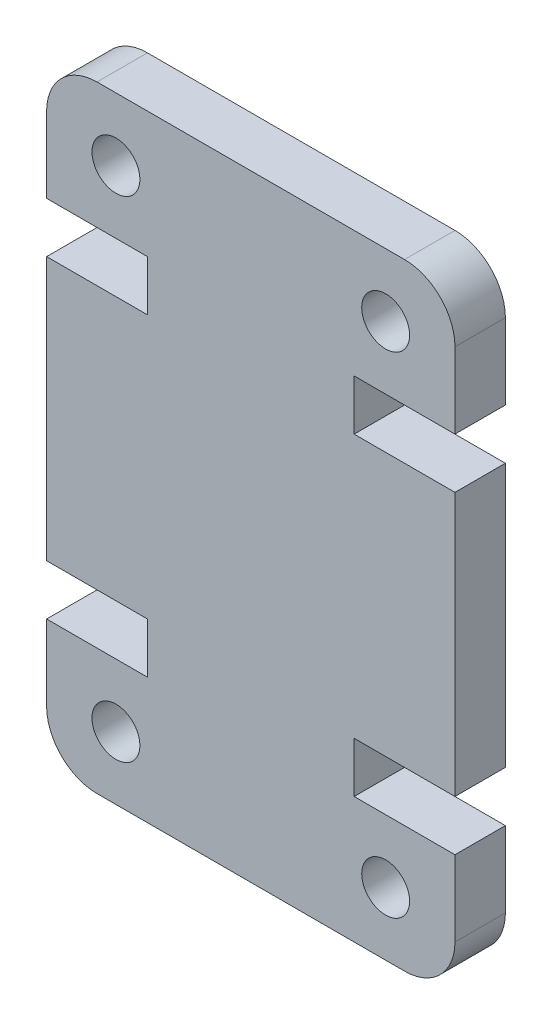
ISO-10303-21;
HEADER;
FILE_DESCRIPTION(('STEP AP214'),'2;1');
FILE_NAME('part.step','',(''),(''),'','','');
FILE_SCHEMA(('AUTOMOTIVE_DESIGN { 1 0 10303 214 1 1 1 1 }'));
ENDSEC;
DATA;
#1=APPLICATION_CONTEXT('core data for automotive mechanical design processes');
#2=APPLICATION_PROTOCOL_DEFINITION('international standard','automotive_design',2000,#1);
#3=PRODUCT_CONTEXT('',#1,'mechanical');
#4=PRODUCT('Part','Part','',(#3));
#5=PRODUCT_RELATED_PRODUCT_CATEGORY('part','',(#4));
#6=PRODUCT_DEFINITION_FORMATION('','',#4);
#7=PRODUCT_DEFINITION_CONTEXT('part definition',#1,'design');
#8=PRODUCT_DEFINITION('design','',#6,#7);
#9=PRODUCT_DEFINITION_SHAPE('','',#8);
#10=(LENGTH_UNIT() NAMED_UNIT(*) SI_UNIT(.MILLI.,.METRE.));
#11=(NAMED_UNIT(*) PLANE_ANGLE_UNIT() SI_UNIT($,.RADIAN.));
#12=(NAMED_UNIT(*) SI_UNIT($,.STERADIAN.) SOLID_ANGLE_UNIT());
#13=UNCERTAINTY_MEASURE_WITH_UNIT(LENGTH_MEASURE(1.E-05),#10,'distance_accuracy_value','');
#14=(GEOMETRIC_REPRESENTATION_CONTEXT(3) GLOBAL_UNCERTAINTY_ASSIGNED_CONTEXT((#13)) GLOBAL_UNIT_ASSIGNED_CONTEXT((#10,
#11,#12)) REPRESENTATION_CONTEXT('',''));
#15=CARTESIAN_POINT('',(0.,0.,0.));
#16=DIRECTION('',(0.,0.,1.));
#17=DIRECTION('',(1.,0.,0.));
#18=AXIS2_PLACEMENT_3D('',#15,#16,#17);
#19=CARTESIAN_POINT('',(14.2,2.,4.));
#20=DIRECTION('',(0.,0.,-1.));
#21=DIRECTION('',(-1.,0.,0.));
#22=AXIS2_PLACEMENT_3D('',#19,#20,#21);
#23=CYLINDRICAL_SURFACE('',#22,2.);
#24=CARTESIAN_POINT('',(14.2,2.,2.));
#25=DIRECTION('',(0.,0.,-1.));
#26=DIRECTION('',(-1.,0.,0.));
#27=AXIS2_PLACEMENT_3D('',#24,#25,#26);
#28=CIRCLE('',#27,2.);
#29=CARTESIAN_POINT('',(16.2,2.00000000000001,2.));
#30=VERTEX_POINT('',#29);
#31=CARTESIAN_POINT('',(14.2,0.,2.));
#32=VERTEX_POINT('',#31);
#33=EDGE_CURVE('E47',#30,#32,#28,.T.);
#34=ORIENTED_EDGE('',*,*,#33,.F.);
#35=DIRECTION('',(0.,0.,-1.));
#36=VECTOR('',#35,1.);
#37=CARTESIAN_POINT('',(16.2,2.,4.));
#38=LINE('',#37,#36);
#39=CARTESIAN_POINT('',(16.2,2.,4.));
#40=VERTEX_POINT('',#39);
#41=EDGE_CURVE('E11',#40,#30,#38,.T.);
#42=ORIENTED_EDGE('',*,*,#41,.F.);
#43=CARTESIAN_POINT('',(14.2,2.,4.));
#44=DIRECTION('',(0.,0.,1.));
#45=DIRECTION('',(-1.,0.,0.));
#46=AXIS2_PLACEMENT_3D('',#43,#44,#45);
#47=CIRCLE('',#46,2.);
#48=CARTESIAN_POINT('',(14.2,0.,4.));
#49=VERTEX_POINT('',#48);
#50=EDGE_CURVE('E352',#49,#40,#47,.T.);
#51=ORIENTED_EDGE('',*,*,#50,.F.);
#52=DIRECTION('',(0.,0.,-1.));
#53=VECTOR('',#52,1.);
#54=CARTESIAN_POINT('',(14.2,0.,4.));
#55=LINE('',#54,#53);
#56=EDGE_CURVE('E213',#49,#32,#55,.T.);
#57=ORIENTED_EDGE('',*,*,#56,.T.);
#58=EDGE_LOOP('',(#34,#42,#51,#57));
#59=FACE_BOUND('',#58,.T.);
#60=ADVANCED_FACE('F32',(#59),#23,.T.);
#61=CARTESIAN_POINT('',(16.2,5.00000000000014,4.));
#62=DIRECTION('',(-1.,0.,0.));
#63=DIRECTION('',(0.,0.,1.));
#64=AXIS2_PLACEMENT_3D('',#61,#62,#63);
#65=PLANE('',#64);
#66=DIRECTION('',(0.,-1.,0.));
#67=VECTOR('',#66,1.);
#68=CARTESIAN_POINT('',(16.2,24.45,2.));
#69=LINE('',#68,#67);
#70=CARTESIAN_POINT('',(16.2,5.00000000000014,2.));
#71=VERTEX_POINT('',#70);
#72=EDGE_CURVE('E289',#71,#30,#69,.T.);
#73=ORIENTED_EDGE('',*,*,#72,.F.);
#74=DIRECTION('',(0.,0.,-1.));
#75=VECTOR('',#74,1.);
#76=CARTESIAN_POINT('',(16.2,5.00000000000014,4.));
#77=LINE('',#76,#75);
#78=CARTESIAN_POINT('',(16.2,5.00000000000014,4.));
#79=VERTEX_POINT('',#78);
#80=EDGE_CURVE('E40',#79,#71,#77,.T.);
#81=ORIENTED_EDGE('',*,*,#80,.F.);
#82=DIRECTION('',(0.,1.,0.));
#83=VECTOR('',#82,1.);
#84=CARTESIAN_POINT('',(16.2,5.00000000000014,4.));
#85=LINE('',#84,#83);
#86=EDGE_CURVE('E288',#40,#79,#85,.T.);
#87=ORIENTED_EDGE('',*,*,#86,.F.);
#88=ORIENTED_EDGE('',*,*,#41,.T.);
#89=EDGE_LOOP('',(#73,#81,#87,#88));
#90=FACE_BOUND('',#89,.T.);
#91=ADVANCED_FACE('F287',(#90),#65,.F.);
#92=CARTESIAN_POINT('',(12.2,5.00000000000014,4.));
#93=DIRECTION('',(0.,-1.,0.));
#94=DIRECTION('',(0.,0.,-1.));
#95=AXIS2_PLACEMENT_3D('',#92,#93,#94);
#96=PLANE('',#95);
#97=DIRECTION('',(1.,0.,0.));
#98=VECTOR('',#97,1.);
#99=CARTESIAN_POINT('',(12.2,5.00000000000014,2.));
#100=LINE('',#99,#98);
#101=CARTESIAN_POINT('',(12.2,5.00000000000014,2.));
#102=VERTEX_POINT('',#101);
#103=EDGE_CURVE('E283',#102,#71,#100,.T.);
#104=ORIENTED_EDGE('',*,*,#103,.F.);
#105=DIRECTION('',(0.,0.,-1.));
#106=VECTOR('',#105,1.);
#107=CARTESIAN_POINT('',(12.2,5.00000000000014,4.));
#108=LINE('',#107,#106);
#109=CARTESIAN_POINT('',(12.2,5.00000000000014,4.));
#110=VERTEX_POINT('',#109);
#111=EDGE_CURVE('E273',#110,#102,#108,.T.);
#112=ORIENTED_EDGE('',*,*,#111,.F.);
#113=DIRECTION('',(-1.,0.,0.));
#114=VECTOR('',#113,1.);
#115=CARTESIAN_POINT('',(12.2,5.00000000000014,4.));
#116=LINE('',#115,#114);
#117=EDGE_CURVE('E284',#79,#110,#116,.T.);
#118=ORIENTED_EDGE('',*,*,#117,.F.);
#119=ORIENTED_EDGE('',*,*,#80,.T.);
#120=EDGE_LOOP('',(#104,#112,#118,#119));
#121=FACE_BOUND('',#120,.T.);
#122=ADVANCED_FACE('F281',(#121),#96,.F.);
#123=CARTESIAN_POINT('',(12.2,7.00000000000014,4.));
#124=DIRECTION('',(-1.,0.,0.));
#125=DIRECTION('',(0.,0.,1.));
#126=AXIS2_PLACEMENT_3D('',#123,#124,#125);
#127=PLANE('',#126);
#128=DIRECTION('',(0.,-1.,0.));
#129=VECTOR('',#128,1.);
#130=CARTESIAN_POINT('',(12.2,7.00000000000014,2.));
#131=LINE('',#130,#129);
#132=CARTESIAN_POINT('',(12.2,7.00000000000014,2.));
#133=VERTEX_POINT('',#132);
#134=EDGE_CURVE('E336',#133,#102,#131,.T.);
#135=ORIENTED_EDGE('',*,*,#134,.F.);
#136=DIRECTION('',(0.,0.,-1.));
#137=VECTOR('',#136,1.);
#138=CARTESIAN_POINT('',(12.2,7.00000000000014,4.));
#139=LINE('',#138,#137);
#140=CARTESIAN_POINT('',(12.2,7.00000000000014,4.));
#141=VERTEX_POINT('',#140);
#142=EDGE_CURVE('E270',#141,#133,#139,.T.);
#143=ORIENTED_EDGE('',*,*,#142,.F.);
#144=DIRECTION('',(0.,1.,0.));
#145=VECTOR('',#144,1.);
#146=CARTESIAN_POINT('',(12.2,7.00000000000014,4.));
#147=LINE('',#146,#145);
#148=EDGE_CURVE('E356',#110,#141,#147,.T.);
#149=ORIENTED_EDGE('',*,*,#148,.F.);
#150=ORIENTED_EDGE('',*,*,#111,.T.);
#151=EDGE_LOOP('',(#135,#143,#149,#150));
#152=FACE_BOUND('',#151,.T.);
#153=ADVANCED_FACE('F459',(#152),#127,.F.);
#154=CARTESIAN_POINT('',(16.2,7.00000000000014,4.));
#155=DIRECTION('',(0.,1.,0.));
#156=DIRECTION('',(-1.,0.,0.));
#157=AXIS2_PLACEMENT_3D('',#154,#155,#156);
#158=PLANE('',#157);
#159=DIRECTION('',(-1.,0.,0.));
#160=VECTOR('',#159,1.);
#161=CARTESIAN_POINT('',(16.2,7.00000000000014,2.));
#162=LINE('',#161,#160);
#163=CARTESIAN_POINT('',(16.2,7.00000000000014,2.));
#164=VERTEX_POINT('',#163);
#165=EDGE_CURVE('E334',#164,#133,#162,.T.);
#166=ORIENTED_EDGE('',*,*,#165,.F.);
#167=DIRECTION('',(0.,0.,-1.));
#168=VECTOR('',#167,1.);
#169=CARTESIAN_POINT('',(16.2,7.00000000000014,4.));
#170=LINE('',#169,#168);
#171=CARTESIAN_POINT('',(16.2,7.00000000000014,4.));
#172=VERTEX_POINT('',#171);
#173=EDGE_CURVE('E267',#172,#164,#170,.T.);
#174=ORIENTED_EDGE('',*,*,#173,.F.);
#175=DIRECTION('',(1.,0.,0.));
#176=VECTOR('',#175,1.);
#177=CARTESIAN_POINT('',(16.2,7.00000000000014,4.));
#178=LINE('',#177,#176);
#179=EDGE_CURVE('E358',#141,#172,#178,.T.);
#180=ORIENTED_EDGE('',*,*,#179,.F.);
#181=ORIENTED_EDGE('',*,*,#142,.T.);
#182=EDGE_LOOP('',(#166,#174,#180,#181));
#183=FACE_BOUND('',#182,.T.);
#184=ADVANCED_FACE('F455',(#183),#158,.F.);
#185=CARTESIAN_POINT('',(16.2,17.4499999999999,4.));
#186=DIRECTION('',(-1.,0.,0.));
#187=DIRECTION('',(0.,0.,1.));
#188=AXIS2_PLACEMENT_3D('',#185,#186,#187);
#189=PLANE('',#188);
#190=CARTESIAN_POINT('',(16.2,17.4499999999999,2.));
#191=VERTEX_POINT('',#190);
#192=EDGE_CURVE('E291',#191,#164,#69,.T.);
#193=ORIENTED_EDGE('',*,*,#192,.F.);
#194=DIRECTION('',(0.,0.,-1.));
#195=VECTOR('',#194,1.);
#196=CARTESIAN_POINT('',(16.2,17.4499999999999,4.));
#197=LINE('',#196,#195);
#198=CARTESIAN_POINT('',(16.2,17.4499999999999,4.));
#199=VERTEX_POINT('',#198);
#200=EDGE_CURVE('E264',#199,#191,#197,.T.);
#201=ORIENTED_EDGE('',*,*,#200,.F.);
#202=DIRECTION('',(0.,1.,0.));
#203=VECTOR('',#202,1.);
#204=CARTESIAN_POINT('',(16.2,17.4499999999999,4.));
#205=LINE('',#204,#203);
#206=EDGE_CURVE('E360',#172,#199,#205,.T.);
#207=ORIENTED_EDGE('',*,*,#206,.F.);
#208=ORIENTED_EDGE('',*,*,#173,.T.);
#209=EDGE_LOOP('',(#193,#201,#207,#208));
#210=FACE_BOUND('',#209,.T.);
#211=ADVANCED_FACE('F450',(#210),#189,.F.);
#212=CARTESIAN_POINT('',(16.2,17.4499999999999,4.));
#213=DIRECTION('',(0.,-1.,0.));
#214=DIRECTION('',(1.,0.,0.));
#215=AXIS2_PLACEMENT_3D('',#212,#213,#214);
#216=PLANE('',#215);
#217=DIRECTION('',(1.,0.,0.));
#218=VECTOR('',#217,1.);
#219=CARTESIAN_POINT('',(16.2,17.4499999999999,2.));
#220=LINE('',#219,#218);
#221=CARTESIAN_POINT('',(12.2,17.4499999999999,2.));
#222=VERTEX_POINT('',#221);
#223=EDGE_CURVE('E332',#222,#191,#220,.T.);
#224=ORIENTED_EDGE('',*,*,#223,.F.);
#225=DIRECTION('',(0.,0.,-1.));
#226=VECTOR('',#225,1.);
#227=CARTESIAN_POINT('',(12.2,17.4499999999999,4.));
#228=LINE('',#227,#226);
#229=CARTESIAN_POINT('',(12.2,17.4499999999999,4.));
#230=VERTEX_POINT('',#229);
#231=EDGE_CURVE('E261',#230,#222,#228,.T.);
#232=ORIENTED_EDGE('',*,*,#231,.F.);
#233=DIRECTION('',(-1.,0.,0.));
#234=VECTOR('',#233,1.);
#235=CARTESIAN_POINT('',(16.2,17.4499999999999,4.));
#236=LINE('',#235,#234);
#237=EDGE_CURVE('E362',#199,#230,#236,.T.);
#238=ORIENTED_EDGE('',*,*,#237,.F.);
#239=ORIENTED_EDGE('',*,*,#200,.T.);
#240=EDGE_LOOP('',(#224,#232,#238,#239));
#241=FACE_BOUND('',#240,.T.);
#242=ADVANCED_FACE('F445',(#241),#216,.F.);
#243=CARTESIAN_POINT('',(12.2,17.4499999999999,4.));
#244=DIRECTION('',(-1.,0.,0.));
#245=DIRECTION('',(0.,0.,1.));
#246=AXIS2_PLACEMENT_3D('',#243,#244,#245);
#247=PLANE('',#246);
#248=DIRECTION('',(0.,-1.,0.));
#249=VECTOR('',#248,1.);
#250=CARTESIAN_POINT('',(12.2,17.4499999999999,2.));
#251=LINE('',#250,#249);
#252=CARTESIAN_POINT('',(12.2,19.4499999999999,2.));
#253=VERTEX_POINT('',#252);
#254=EDGE_CURVE('E330',#253,#222,#251,.T.);
#255=ORIENTED_EDGE('',*,*,#254,.F.);
#256=DIRECTION('',(0.,0.,-1.));
#257=VECTOR('',#256,1.);
#258=CARTESIAN_POINT('',(12.2,19.4499999999999,4.));
#259=LINE('',#258,#257);
#260=CARTESIAN_POINT('',(12.2,19.4499999999999,4.));
#261=VERTEX_POINT('',#260);
#262=EDGE_CURVE('E258',#261,#253,#259,.T.);
#263=ORIENTED_EDGE('',*,*,#262,.F.);
#264=DIRECTION('',(0.,1.,0.));
#265=VECTOR('',#264,1.);
#266=CARTESIAN_POINT('',(12.2,17.4499999999999,4.));
#267=LINE('',#266,#265);
#268=EDGE_CURVE('E364',#230,#261,#267,.T.);
#269=ORIENTED_EDGE('',*,*,#268,.F.);
#270=ORIENTED_EDGE('',*,*,#231,.T.);
#271=EDGE_LOOP('',(#255,#263,#269,#270));
#272=FACE_BOUND('',#271,.T.);
#273=ADVANCED_FACE('F440',(#272),#247,.F.);
#274=CARTESIAN_POINT('',(12.2,19.4499999999999,4.));
#275=DIRECTION('',(0.,1.,0.));
#276=DIRECTION('',(0.,0.,1.));
#277=AXIS2_PLACEMENT_3D('',#274,#275,#276);
#278=PLANE('',#277);
#279=DIRECTION('',(-1.,0.,0.));
#280=VECTOR('',#279,1.);
#281=CARTESIAN_POINT('',(12.2,19.4499999999999,2.));
#282=LINE('',#281,#280);
#283=CARTESIAN_POINT('',(16.2,19.4499999999999,2.));
#284=VERTEX_POINT('',#283);
#285=EDGE_CURVE('E328',#284,#253,#282,.T.);
#286=ORIENTED_EDGE('',*,*,#285,.F.);
#287=DIRECTION('',(0.,0.,-1.));
#288=VECTOR('',#287,1.);
#289=CARTESIAN_POINT('',(16.2,19.4499999999999,4.));
#290=LINE('',#289,#288);
#291=CARTESIAN_POINT('',(16.2,19.4499999999999,4.));
#292=VERTEX_POINT('',#291);
#293=EDGE_CURVE('E255',#292,#284,#290,.T.);
#294=ORIENTED_EDGE('',*,*,#293,.F.);
#295=DIRECTION('',(1.,0.,0.));
#296=VECTOR('',#295,1.);
#297=CARTESIAN_POINT('',(12.2,19.4499999999999,4.));
#298=LINE('',#297,#296);
#299=EDGE_CURVE('E366',#261,#292,#298,.T.);
#300=ORIENTED_EDGE('',*,*,#299,.F.);
#301=ORIENTED_EDGE('',*,*,#262,.T.);
#302=EDGE_LOOP('',(#286,#294,#300,#301));
#303=FACE_BOUND('',#302,.T.);
#304=ADVANCED_FACE('F435',(#303),#278,.F.);
#305=CARTESIAN_POINT('',(16.2,19.4499999999999,4.));
#306=DIRECTION('',(-1.,0.,0.));
#307=DIRECTION('',(0.,0.,1.));
#308=AXIS2_PLACEMENT_3D('',#305,#306,#307);
#309=PLANE('',#308);
#310=CARTESIAN_POINT('',(16.2,22.45,2.));
#311=VERTEX_POINT('',#310);
#312=EDGE_CURVE('E294',#311,#284,#69,.T.);
#313=ORIENTED_EDGE('',*,*,#312,.F.);
#314=DIRECTION('',(0.,0.,-1.));
#315=VECTOR('',#314,1.);
#316=CARTESIAN_POINT('',(16.2,22.45,4.));
#317=LINE('',#316,#315);
#318=CARTESIAN_POINT('',(16.2,22.45,4.));
#319=VERTEX_POINT('',#318);
#320=EDGE_CURVE('E252',#319,#311,#317,.T.);
#321=ORIENTED_EDGE('',*,*,#320,.F.);
#322=DIRECTION('',(0.,1.,0.));
#323=VECTOR('',#322,1.);
#324=CARTESIAN_POINT('',(16.2,19.4499999999999,4.));
#325=LINE('',#324,#323);
#326=EDGE_CURVE('E368',#292,#319,#325,.T.);
#327=ORIENTED_EDGE('',*,*,#326,.F.);
#328=ORIENTED_EDGE('',*,*,#293,.T.);
#329=EDGE_LOOP('',(#313,#321,#327,#328));
#330=FACE_BOUND('',#329,.T.);
#331=ADVANCED_FACE('F431',(#330),#309,.F.);
#332=CARTESIAN_POINT('',(14.2,22.45,4.));
#333=DIRECTION('',(0.,0.,-1.));
#334=DIRECTION('',(-1.,0.,0.));
#335=AXIS2_PLACEMENT_3D('',#332,#333,#334);
#336=CYLINDRICAL_SURFACE('',#335,2.);
#337=CARTESIAN_POINT('',(14.2,22.45,2.));
#338=DIRECTION('',(0.,0.,-1.));
#339=DIRECTION('',(-1.,0.,0.));
#340=AXIS2_PLACEMENT_3D('',#337,#338,#339);
#341=CIRCLE('',#340,2.);
#342=CARTESIAN_POINT('',(14.2,24.45,2.));
#343=VERTEX_POINT('',#342);
#344=EDGE_CURVE('E326',#343,#311,#341,.T.);
#345=ORIENTED_EDGE('',*,*,#344,.F.);
#346=DIRECTION('',(0.,0.,-1.));
#347=VECTOR('',#346,1.);
#348=CARTESIAN_POINT('',(14.2,24.45,4.));
#349=LINE('',#348,#347);
#350=CARTESIAN_POINT('',(14.2,24.45,4.));
#351=VERTEX_POINT('',#350);
#352=EDGE_CURVE('E249',#351,#343,#349,.T.);
#353=ORIENTED_EDGE('',*,*,#352,.F.);
#354=CARTESIAN_POINT('',(14.2,22.45,4.));
#355=DIRECTION('',(0.,0.,1.));
#356=DIRECTION('',(1.,0.,0.));
#357=AXIS2_PLACEMENT_3D('',#354,#355,#356);
#358=CIRCLE('',#357,2.);
#359=EDGE_CURVE('E370',#319,#351,#358,.T.);
#360=ORIENTED_EDGE('',*,*,#359,.F.);
#361=ORIENTED_EDGE('',*,*,#320,.T.);
#362=EDGE_LOOP('',(#345,#353,#360,#361));
#363=FACE_BOUND('',#362,.T.);
#364=ADVANCED_FACE('F427',(#363),#336,.T.);
#365=CARTESIAN_POINT('',(1.99999999999999,24.45,4.));
#366=DIRECTION('',(0.,-1.,0.));
#367=DIRECTION('',(0.,0.,-1.));
#368=AXIS2_PLACEMENT_3D('',#365,#366,#367);
#369=PLANE('',#368);
#370=DIRECTION('',(1.,0.,0.));
#371=VECTOR('',#370,1.);
#372=CARTESIAN_POINT('',(0.,24.45,2.));
#373=LINE('',#372,#371);
#374=CARTESIAN_POINT('',(2.,24.45,2.));
#375=VERTEX_POINT('',#374);
#376=EDGE_CURVE('E292',#375,#343,#373,.T.);
#377=ORIENTED_EDGE('',*,*,#376,.F.);
#378=DIRECTION('',(0.,0.,-1.));
#379=VECTOR('',#378,1.);
#380=CARTESIAN_POINT('',(1.99999999999999,24.45,4.));
#381=LINE('',#380,#379);
#382=CARTESIAN_POINT('',(1.99999999999999,24.45,4.));
#383=VERTEX_POINT('',#382);
#384=EDGE_CURVE('E246',#383,#375,#381,.T.);
#385=ORIENTED_EDGE('',*,*,#384,.F.);
#386=DIRECTION('',(-1.,0.,0.));
#387=VECTOR('',#386,1.);
#388=CARTESIAN_POINT('',(1.99999999999999,24.45,4.));
#389=LINE('',#388,#387);
#390=EDGE_CURVE('E372',#351,#383,#389,.T.);
#391=ORIENTED_EDGE('',*,*,#390,.F.);
#392=ORIENTED_EDGE('',*,*,#352,.T.);
#393=EDGE_LOOP('',(#377,#385,#391,#392));
#394=FACE_BOUND('',#393,.T.);
#395=ADVANCED_FACE('F424',(#394),#369,.F.);
#396=CARTESIAN_POINT('',(2.,22.45,4.));
#397=DIRECTION('',(0.,0.,-1.));
#398=DIRECTION('',(-1.,0.,0.));
#399=AXIS2_PLACEMENT_3D('',#396,#397,#398);
#400=CYLINDRICAL_SURFACE('',#399,2.);
#401=CARTESIAN_POINT('',(2.,22.45,2.));
#402=DIRECTION('',(0.,0.,-1.));
#403=DIRECTION('',(-1.,0.,0.));
#404=AXIS2_PLACEMENT_3D('',#401,#402,#403);
#405=CIRCLE('',#404,2.);
#406=CARTESIAN_POINT('',(0.,22.45,2.));
#407=VERTEX_POINT('',#406);
#408=EDGE_CURVE('E324',#407,#375,#405,.T.);
#409=ORIENTED_EDGE('',*,*,#408,.F.);
#410=DIRECTION('',(0.,0.,-1.));
#411=VECTOR('',#410,1.);
#412=CARTESIAN_POINT('',(0.,22.45,4.));
#413=LINE('',#412,#411);
#414=CARTESIAN_POINT('',(0.,22.45,4.));
#415=VERTEX_POINT('',#414);
#416=EDGE_CURVE('E243',#415,#407,#413,.T.);
#417=ORIENTED_EDGE('',*,*,#416,.F.);
#418=CARTESIAN_POINT('',(2.,22.45,4.));
#419=DIRECTION('',(0.,0.,1.));
#420=DIRECTION('',(-1.,0.,0.));
#421=AXIS2_PLACEMENT_3D('',#418,#419,#420);
#422=CIRCLE('',#421,2.);
#423=EDGE_CURVE('E374',#383,#415,#422,.T.);
#424=ORIENTED_EDGE('',*,*,#423,.F.);
#425=ORIENTED_EDGE('',*,*,#384,.T.);
#426=EDGE_LOOP('',(#409,#417,#424,#425));
#427=FACE_BOUND('',#426,.T.);
#428=ADVANCED_FACE('F413',(#427),#400,.T.);
#429=CARTESIAN_POINT('',(0.,19.4499999999999,4.));
#430=DIRECTION('',(1.,0.,0.));
#431=DIRECTION('',(0.,1.,0.));
#432=AXIS2_PLACEMENT_3D('',#429,#430,#431);
#433=PLANE('',#432);
#434=DIRECTION('',(0.,1.,0.));
#435=VECTOR('',#434,1.);
#436=CARTESIAN_POINT('',(0.,0.,2.));
#437=LINE('',#436,#435);
#438=CARTESIAN_POINT('',(0.,19.4499999999999,2.));
#439=VERTEX_POINT('',#438);
#440=EDGE_CURVE('E199',#439,#407,#437,.T.);
#441=ORIENTED_EDGE('',*,*,#440,.F.);
#442=DIRECTION('',(0.,0.,-1.));
#443=VECTOR('',#442,1.);
#444=CARTESIAN_POINT('',(0.,19.4499999999999,4.));
#445=LINE('',#444,#443);
#446=CARTESIAN_POINT('',(0.,19.4499999999999,4.));
#447=VERTEX_POINT('',#446);
#448=EDGE_CURVE('E240',#447,#439,#445,.T.);
#449=ORIENTED_EDGE('',*,*,#448,.F.);
#450=DIRECTION('',(0.,-1.,0.));
#451=VECTOR('',#450,1.);
#452=CARTESIAN_POINT('',(0.,19.4499999999999,4.));
#453=LINE('',#452,#451);
#454=EDGE_CURVE('E376',#415,#447,#453,.T.);
#455=ORIENTED_EDGE('',*,*,#454,.F.);
#456=ORIENTED_EDGE('',*,*,#416,.T.);
#457=EDGE_LOOP('',(#441,#449,#455,#456));
#458=FACE_BOUND('',#457,.T.);
#459=ADVANCED_FACE('F417',(#458),#433,.F.);
#460=CARTESIAN_POINT('',(3.99999999999999,19.4499999999999,4.));
#461=DIRECTION('',(0.,1.,0.));
#462=DIRECTION('',(-1.,0.,0.));
#463=AXIS2_PLACEMENT_3D('',#460,#461,#462);
#464=PLANE('',#463);
#465=DIRECTION('',(-1.,0.,0.));
#466=VECTOR('',#465,1.);
#467=CARTESIAN_POINT('',(3.99999999999999,19.4499999999999,2.));
#468=LINE('',#467,#466);
#469=CARTESIAN_POINT('',(3.99999999999999,19.4499999999999,2.));
#470=VERTEX_POINT('',#469);
#471=EDGE_CURVE('E322',#470,#439,#468,.T.);
#472=ORIENTED_EDGE('',*,*,#471,.F.);
#473=DIRECTION('',(0.,0.,-1.));
#474=VECTOR('',#473,1.);
#475=CARTESIAN_POINT('',(3.99999999999999,19.4499999999999,4.));
#476=LINE('',#475,#474);
#477=CARTESIAN_POINT('',(3.99999999999999,19.4499999999999,4.));
#478=VERTEX_POINT('',#477);
#479=EDGE_CURVE('E237',#478,#470,#476,.T.);
#480=ORIENTED_EDGE('',*,*,#479,.F.);
#481=DIRECTION('',(1.,0.,0.));
#482=VECTOR('',#481,1.);
#483=CARTESIAN_POINT('',(3.99999999999999,19.4499999999999,4.));
#484=LINE('',#483,#482);
#485=EDGE_CURVE('E378',#447,#478,#484,.T.);
#486=ORIENTED_EDGE('',*,*,#485,.F.);
#487=ORIENTED_EDGE('',*,*,#448,.T.);
#488=EDGE_LOOP('',(#472,#480,#486,#487));
#489=FACE_BOUND('',#488,.T.);
#490=ADVANCED_FACE('F494',(#489),#464,.F.);
#491=CARTESIAN_POINT('',(3.99999999999999,17.4499999999999,4.));
#492=DIRECTION('',(1.,0.,0.));
#493=DIRECTION('',(0.,0.,-1.));
#494=AXIS2_PLACEMENT_3D('',#491,#492,#493);
#495=PLANE('',#494);
#496=DIRECTION('',(0.,1.,0.));
#497=VECTOR('',#496,1.);
#498=CARTESIAN_POINT('',(3.99999999999999,17.4499999999999,2.));
#499=LINE('',#498,#497);
#500=CARTESIAN_POINT('',(3.99999999999999,17.4499999999999,2.));
#501=VERTEX_POINT('',#500);
#502=EDGE_CURVE('E320',#501,#470,#499,.T.);
#503=ORIENTED_EDGE('',*,*,#502,.F.);
#504=DIRECTION('',(0.,0.,-1.));
#505=VECTOR('',#504,1.);
#506=CARTESIAN_POINT('',(3.99999999999999,17.4499999999999,4.));
#507=LINE('',#506,#505);
#508=CARTESIAN_POINT('',(3.99999999999999,17.4499999999999,4.));
#509=VERTEX_POINT('',#508);
#510=EDGE_CURVE('E234',#509,#501,#507,.T.);
#511=ORIENTED_EDGE('',*,*,#510,.F.);
#512=DIRECTION('',(0.,-1.,0.));
#513=VECTOR('',#512,1.);
#514=CARTESIAN_POINT('',(3.99999999999999,17.4499999999999,4.));
#515=LINE('',#514,#513);
#516=EDGE_CURVE('E380',#478,#509,#515,.T.);
#517=ORIENTED_EDGE('',*,*,#516,.F.);
#518=ORIENTED_EDGE('',*,*,#479,.T.);
#519=EDGE_LOOP('',(#503,#511,#517,#518));
#520=FACE_BOUND('',#519,.T.);
#521=ADVANCED_FACE('F497',(#520),#495,.F.);
#522=CARTESIAN_POINT('',(0.,17.4499999999999,4.));
#523=DIRECTION('',(0.,-1.,0.));
#524=DIRECTION('',(1.,0.,0.));
#525=AXIS2_PLACEMENT_3D('',#522,#523,#524);
#526=PLANE('',#525);
#527=DIRECTION('',(1.,0.,0.));
#528=VECTOR('',#527,1.);
#529=CARTESIAN_POINT('',(0.,17.4499999999999,2.));
#530=LINE('',#529,#528);
#531=CARTESIAN_POINT('',(0.,17.4499999999999,2.));
#532=VERTEX_POINT('',#531);
#533=EDGE_CURVE('E318',#532,#501,#530,.T.);
#534=ORIENTED_EDGE('',*,*,#533,.F.);
#535=DIRECTION('',(0.,0.,-1.));
#536=VECTOR('',#535,1.);
#537=CARTESIAN_POINT('',(0.,17.4499999999999,4.));
#538=LINE('',#537,#536);
#539=CARTESIAN_POINT('',(0.,17.4499999999999,4.));
#540=VERTEX_POINT('',#539);
#541=EDGE_CURVE('E231',#540,#532,#538,.T.);
#542=ORIENTED_EDGE('',*,*,#541,.F.);
#543=DIRECTION('',(-1.,0.,0.));
#544=VECTOR('',#543,1.);
#545=CARTESIAN_POINT('',(0.,17.4499999999999,4.));
#546=LINE('',#545,#544);
#547=EDGE_CURVE('E382',#509,#540,#546,.T.);
#548=ORIENTED_EDGE('',*,*,#547,.F.);
#549=ORIENTED_EDGE('',*,*,#510,.T.);
#550=EDGE_LOOP('',(#534,#542,#548,#549));
#551=FACE_BOUND('',#550,.T.);
#552=ADVANCED_FACE('F501',(#551),#526,.F.);
#553=CARTESIAN_POINT('',(0.,17.4499999999999,4.));
#554=DIRECTION('',(1.,0.,0.));
#555=DIRECTION('',(0.,0.,-1.));
#556=AXIS2_PLACEMENT_3D('',#553,#554,#555);
#557=PLANE('',#556);
#558=CARTESIAN_POINT('',(0.,7.00000000000013,2.));
#559=VERTEX_POINT('',#558);
#560=EDGE_CURVE('E403',#559,#532,#437,.T.);
#561=ORIENTED_EDGE('',*,*,#560,.F.);
#562=DIRECTION('',(0.,0.,-1.));
#563=VECTOR('',#562,1.);
#564=CARTESIAN_POINT('',(0.,7.00000000000012,4.));
#565=LINE('',#564,#563);
#566=CARTESIAN_POINT('',(0.,7.00000000000012,4.));
#567=VERTEX_POINT('',#566);
#568=EDGE_CURVE('E228',#567,#559,#565,.T.);
#569=ORIENTED_EDGE('',*,*,#568,.F.);
#570=DIRECTION('',(0.,-1.,0.));
#571=VECTOR('',#570,1.);
#572=CARTESIAN_POINT('',(0.,17.4499999999999,4.));
#573=LINE('',#572,#571);
#574=EDGE_CURVE('E384',#540,#567,#573,.T.);
#575=ORIENTED_EDGE('',*,*,#574,.F.);
#576=ORIENTED_EDGE('',*,*,#541,.T.);
#577=EDGE_LOOP('',(#561,#569,#575,#576));
#578=FACE_BOUND('',#577,.T.);
#579=ADVANCED_FACE('F505',(#578),#557,.F.);
#580=CARTESIAN_POINT('',(0.,7.00000000000012,4.));
#581=DIRECTION('',(0.,1.,0.));
#582=DIRECTION('',(-1.,0.,0.));
#583=AXIS2_PLACEMENT_3D('',#580,#581,#582);
#584=PLANE('',#583);
#585=DIRECTION('',(-1.,0.,0.));
#586=VECTOR('',#585,1.);
#587=CARTESIAN_POINT('',(0.,7.00000000000012,2.));
#588=LINE('',#587,#586);
#589=CARTESIAN_POINT('',(4.,7.00000000000014,2.));
#590=VERTEX_POINT('',#589);
#591=EDGE_CURVE('E316',#590,#559,#588,.T.);
#592=ORIENTED_EDGE('',*,*,#591,.F.);
#593=DIRECTION('',(0.,0.,-1.));
#594=VECTOR('',#593,1.);
#595=CARTESIAN_POINT('',(4.,7.00000000000014,4.));
#596=LINE('',#595,#594);
#597=CARTESIAN_POINT('',(4.,7.00000000000014,4.));
#598=VERTEX_POINT('',#597);
#599=EDGE_CURVE('E225',#598,#590,#596,.T.);
#600=ORIENTED_EDGE('',*,*,#599,.F.);
#601=DIRECTION('',(1.,0.,0.));
#602=VECTOR('',#601,1.);
#603=CARTESIAN_POINT('',(0.,7.00000000000012,4.));
#604=LINE('',#603,#602);
#605=EDGE_CURVE('E386',#567,#598,#604,.T.);
#606=ORIENTED_EDGE('',*,*,#605,.F.);
#607=ORIENTED_EDGE('',*,*,#568,.T.);
#608=EDGE_LOOP('',(#592,#600,#606,#607));
#609=FACE_BOUND('',#608,.T.);
#610=ADVANCED_FACE('F509',(#609),#584,.F.);
#611=CARTESIAN_POINT('',(4.,7.00000000000014,4.));
#612=DIRECTION('',(1.,0.,0.));
#613=DIRECTION('',(0.,0.,-1.));
#614=AXIS2_PLACEMENT_3D('',#611,#612,#613);
#615=PLANE('',#614);
#616=DIRECTION('',(0.,1.,0.));
#617=VECTOR('',#616,1.);
#618=CARTESIAN_POINT('',(4.,7.00000000000014,2.));
#619=LINE('',#618,#617);
#620=CARTESIAN_POINT('',(4.,5.00000000000014,2.));
#621=VERTEX_POINT('',#620);
#622=EDGE_CURVE('E314',#621,#590,#619,.T.);
#623=ORIENTED_EDGE('',*,*,#622,.F.);
#624=DIRECTION('',(0.,0.,-1.));
#625=VECTOR('',#624,1.);
#626=CARTESIAN_POINT('',(4.,5.00000000000014,4.));
#627=LINE('',#626,#625);
#628=CARTESIAN_POINT('',(4.,5.00000000000014,4.));
#629=VERTEX_POINT('',#628);
#630=EDGE_CURVE('E222',#629,#621,#627,.T.);
#631=ORIENTED_EDGE('',*,*,#630,.F.);
#632=DIRECTION('',(0.,-1.,0.));
#633=VECTOR('',#632,1.);
#634=CARTESIAN_POINT('',(4.,7.00000000000014,4.));
#635=LINE('',#634,#633);
#636=EDGE_CURVE('E388',#598,#629,#635,.T.);
#637=ORIENTED_EDGE('',*,*,#636,.F.);
#638=ORIENTED_EDGE('',*,*,#599,.T.);
#639=EDGE_LOOP('',(#623,#631,#637,#638));
#640=FACE_BOUND('',#639,.T.);
#641=ADVANCED_FACE('F513',(#640),#615,.F.);
#642=CARTESIAN_POINT('',(4.,5.00000000000014,4.));
#643=DIRECTION('',(0.,-1.,0.));
#644=DIRECTION('',(1.,0.,0.));
#645=AXIS2_PLACEMENT_3D('',#642,#643,#644);
#646=PLANE('',#645);
#647=DIRECTION('',(1.,0.,0.));
#648=VECTOR('',#647,1.);
#649=CARTESIAN_POINT('',(4.,5.00000000000014,2.));
#650=LINE('',#649,#648);
#651=CARTESIAN_POINT('',(0.,5.00000000000014,2.));
#652=VERTEX_POINT('',#651);
#653=EDGE_CURVE('E209',#652,#621,#650,.T.);
#654=ORIENTED_EDGE('',*,*,#653,.F.);
#655=DIRECTION('',(0.,0.,-1.));
#656=VECTOR('',#655,1.);
#657=CARTESIAN_POINT('',(0.,5.00000000000014,4.));
#658=LINE('',#657,#656);
#659=CARTESIAN_POINT('',(0.,5.00000000000014,4.));
#660=VERTEX_POINT('',#659);
#661=EDGE_CURVE('E215',#660,#652,#658,.T.);
#662=ORIENTED_EDGE('',*,*,#661,.F.);
#663=DIRECTION('',(-1.,0.,0.));
#664=VECTOR('',#663,1.);
#665=CARTESIAN_POINT('',(4.,5.00000000000014,4.));
#666=LINE('',#665,#664);
#667=EDGE_CURVE('E390',#629,#660,#666,.T.);
#668=ORIENTED_EDGE('',*,*,#667,.F.);
#669=ORIENTED_EDGE('',*,*,#630,.T.);
#670=EDGE_LOOP('',(#654,#662,#668,#669));
#671=FACE_BOUND('',#670,.T.);
#672=ADVANCED_FACE('F517',(#671),#646,.F.);
#673=CARTESIAN_POINT('',(0.,5.00000000000014,4.));
#674=DIRECTION('',(1.,0.,0.));
#675=DIRECTION('',(0.,0.,-1.));
#676=AXIS2_PLACEMENT_3D('',#673,#674,#675);
#677=PLANE('',#676);
#678=CARTESIAN_POINT('',(0.,2.,2.));
#679=VERTEX_POINT('',#678);
#680=EDGE_CURVE('E295',#679,#652,#437,.T.);
#681=ORIENTED_EDGE('',*,*,#680,.F.);
#682=DIRECTION('',(0.,0.,-1.));
#683=VECTOR('',#682,1.);
#684=CARTESIAN_POINT('',(0.,2.00000000000002,4.));
#685=LINE('',#684,#683);
#686=CARTESIAN_POINT('',(0.,2.00000000000002,4.));
#687=VERTEX_POINT('',#686);
#688=EDGE_CURVE('E208',#687,#679,#685,.T.);
#689=ORIENTED_EDGE('',*,*,#688,.F.);
#690=DIRECTION('',(0.,-1.,0.));
#691=VECTOR('',#690,1.);
#692=CARTESIAN_POINT('',(0.,5.00000000000014,4.));
#693=LINE('',#692,#691);
#694=EDGE_CURVE('E392',#660,#687,#693,.T.);
#695=ORIENTED_EDGE('',*,*,#694,.F.);
#696=ORIENTED_EDGE('',*,*,#661,.T.);
#697=EDGE_LOOP('',(#681,#689,#695,#696));
#698=FACE_BOUND('',#697,.T.);
#699=ADVANCED_FACE('F401',(#698),#677,.F.);
#700=CARTESIAN_POINT('',(2.,2.,4.));
#701=DIRECTION('',(0.,0.,-1.));
#702=DIRECTION('',(-1.,0.,0.));
#703=AXIS2_PLACEMENT_3D('',#700,#701,#702);
#704=CYLINDRICAL_SURFACE('',#703,2.);
#705=CARTESIAN_POINT('',(2.,2.,2.));
#706=DIRECTION('',(0.,0.,-1.));
#707=DIRECTION('',(-1.,0.,0.));
#708=AXIS2_PLACEMENT_3D('',#705,#706,#707);
#709=CIRCLE('',#708,2.);
#710=CARTESIAN_POINT('',(2.,0.,2.));
#711=VERTEX_POINT('',#710);
#712=EDGE_CURVE('E194',#711,#679,#709,.T.);
#713=ORIENTED_EDGE('',*,*,#712,.F.);
#714=DIRECTION('',(0.,0.,-1.));
#715=VECTOR('',#714,1.);
#716=CARTESIAN_POINT('',(2.,0.,4.));
#717=LINE('',#716,#715);
#718=CARTESIAN_POINT('',(2.,0.,4.));
#719=VERTEX_POINT('',#718);
#720=EDGE_CURVE('E206',#719,#711,#717,.T.);
#721=ORIENTED_EDGE('',*,*,#720,.F.);
#722=CARTESIAN_POINT('',(2.,2.,4.));
#723=DIRECTION('',(0.,0.,1.));
#724=DIRECTION('',(1.,0.,0.));
#725=AXIS2_PLACEMENT_3D('',#722,#723,#724);
#726=CIRCLE('',#725,2.);
#727=EDGE_CURVE('E394',#687,#719,#726,.T.);
#728=ORIENTED_EDGE('',*,*,#727,.F.);
#729=ORIENTED_EDGE('',*,*,#688,.T.);
#730=EDGE_LOOP('',(#713,#721,#728,#729));
#731=FACE_BOUND('',#730,.T.);
#732=ADVANCED_FACE('F204',(#731),#704,.T.);
#733=CARTESIAN_POINT('',(2.,0.,4.));
#734=DIRECTION('',(0.,1.,0.));
#735=DIRECTION('',(-1.,0.,0.));
#736=AXIS2_PLACEMENT_3D('',#733,#734,#735);
#737=PLANE('',#736);
#738=DIRECTION('',(-1.,0.,0.));
#739=VECTOR('',#738,1.);
#740=CARTESIAN_POINT('',(16.2,0.,2.));
#741=LINE('',#740,#739);
#742=EDGE_CURVE('E191',#32,#711,#741,.T.);
#743=ORIENTED_EDGE('',*,*,#742,.F.);
#744=ORIENTED_EDGE('',*,*,#56,.F.);
#745=DIRECTION('',(1.,0.,0.));
#746=VECTOR('',#745,1.);
#747=CARTESIAN_POINT('',(2.,0.,4.));
#748=LINE('',#747,#746);
#749=EDGE_CURVE('E55',#719,#49,#748,.T.);
#750=ORIENTED_EDGE('',*,*,#749,.F.);
#751=ORIENTED_EDGE('',*,*,#720,.T.);
#752=EDGE_LOOP('',(#743,#744,#750,#751));
#753=FACE_BOUND('',#752,.T.);
#754=ADVANCED_FACE('F212',(#753),#737,.F.);
#755=CARTESIAN_POINT('',(13.4500000000019,2.4999999999999,4.));
#756=DIRECTION('',(0.,0.,-1.));
#757=DIRECTION('',(-1.,0.,0.));
#758=AXIS2_PLACEMENT_3D('',#755,#756,#757);
#759=CYLINDRICAL_SURFACE('',#758,0.949999999999999);
#760=CARTESIAN_POINT('',(13.4500000000019,2.4999999999999,4.));
#761=DIRECTION('',(0.,0.,1.));
#762=DIRECTION('',(-1.,0.,0.));
#763=AXIS2_PLACEMENT_3D('',#760,#761,#762);
#764=CIRCLE('',#763,0.949999999999999);
#765=CARTESIAN_POINT('',(12.5000000000019,2.4999999999999,4.));
#766=VERTEX_POINT('',#765);
#767=EDGE_CURVE('E349',#766,#766,#764,.T.);
#768=ORIENTED_EDGE('',*,*,#767,.T.);
#769=EDGE_LOOP('',(#768));
#770=FACE_BOUND('',#769,.T.);
#771=CARTESIAN_POINT('',(13.4500000000019,2.4999999999999,2.));
#772=DIRECTION('',(0.,0.,-1.));
#773=DIRECTION('',(-1.,0.,0.));
#774=AXIS2_PLACEMENT_3D('',#771,#772,#773);
#775=CIRCLE('',#774,0.949999999999999);
#776=CARTESIAN_POINT('',(12.5000000000019,2.4999999999999,2.));
#777=VERTEX_POINT('',#776);
#778=EDGE_CURVE('E210',#777,#777,#775,.T.);
#779=ORIENTED_EDGE('',*,*,#778,.T.);
#780=EDGE_LOOP('',(#779));
#781=FACE_BOUND('',#780,.T.);
#782=ADVANCED_FACE('F528',(#770,#781),#759,.F.);
#783=CARTESIAN_POINT('',(2.74999999999805,2.4999999999999,4.));
#784=DIRECTION('',(0.,0.,-1.));
#785=DIRECTION('',(-1.,0.,0.));
#786=AXIS2_PLACEMENT_3D('',#783,#784,#785);
#787=CYLINDRICAL_SURFACE('',#786,0.95);
#788=CARTESIAN_POINT('',(2.74999999999805,2.4999999999999,4.));
#789=DIRECTION('',(0.,0.,1.));
#790=DIRECTION('',(1.,0.,0.));
#791=AXIS2_PLACEMENT_3D('',#788,#789,#790);
#792=CIRCLE('',#791,0.95);
#793=CARTESIAN_POINT('',(3.69999999999805,2.4999999999999,4.));
#794=VERTEX_POINT('',#793);
#795=EDGE_CURVE('E346',#794,#794,#792,.T.);
#796=ORIENTED_EDGE('',*,*,#795,.T.);
#797=EDGE_LOOP('',(#796));
#798=FACE_BOUND('',#797,.T.);
#799=CARTESIAN_POINT('',(2.74999999999805,2.4999999999999,2.));
#800=DIRECTION('',(0.,0.,-1.));
#801=DIRECTION('',(-1.,0.,0.));
#802=AXIS2_PLACEMENT_3D('',#799,#800,#801);
#803=CIRCLE('',#802,0.95);
#804=CARTESIAN_POINT('',(1.79999999999805,2.4999999999999,2.));
#805=VERTEX_POINT('',#804);
#806=EDGE_CURVE('E305',#805,#805,#803,.T.);
#807=ORIENTED_EDGE('',*,*,#806,.T.);
#808=EDGE_LOOP('',(#807));
#809=FACE_BOUND('',#808,.T.);
#810=ADVANCED_FACE('F535',(#798,#809),#787,.F.);
#811=CARTESIAN_POINT('',(2.74999999999805,21.9500000000001,4.));
#812=DIRECTION('',(0.,0.,-1.));
#813=DIRECTION('',(-1.,0.,0.));
#814=AXIS2_PLACEMENT_3D('',#811,#812,#813);
#815=CYLINDRICAL_SURFACE('',#814,0.95);
#816=CARTESIAN_POINT('',(2.74999999999805,21.9500000000001,4.));
#817=DIRECTION('',(0.,0.,1.));
#818=DIRECTION('',(-1.,0.,0.));
#819=AXIS2_PLACEMENT_3D('',#816,#817,#818);
#820=CIRCLE('',#819,0.95);
#821=CARTESIAN_POINT('',(1.79999999999805,21.9500000000001,4.));
#822=VERTEX_POINT('',#821);
#823=EDGE_CURVE('E343',#822,#822,#820,.T.);
#824=ORIENTED_EDGE('',*,*,#823,.T.);
#825=EDGE_LOOP('',(#824));
#826=FACE_BOUND('',#825,.T.);
#827=CARTESIAN_POINT('',(2.74999999999805,21.9500000000001,2.));
#828=DIRECTION('',(0.,0.,-1.));
#829=DIRECTION('',(-1.,0.,0.));
#830=AXIS2_PLACEMENT_3D('',#827,#828,#829);
#831=CIRCLE('',#830,0.95);
#832=CARTESIAN_POINT('',(1.79999999999805,21.9500000000001,2.));
#833=VERTEX_POINT('',#832);
#834=EDGE_CURVE('E301',#833,#833,#831,.T.);
#835=ORIENTED_EDGE('',*,*,#834,.T.);
#836=EDGE_LOOP('',(#835));
#837=FACE_BOUND('',#836,.T.);
#838=ADVANCED_FACE('F539',(#826,#837),#815,.F.);
#839=CARTESIAN_POINT('',(13.4500000000019,21.9500000000001,4.));
#840=DIRECTION('',(0.,0.,-1.));
#841=DIRECTION('',(-1.,0.,0.));
#842=AXIS2_PLACEMENT_3D('',#839,#840,#841);
#843=CYLINDRICAL_SURFACE('',#842,0.949999999999999);
#844=CARTESIAN_POINT('',(13.4500000000019,21.9500000000001,4.));
#845=DIRECTION('',(0.,0.,1.));
#846=DIRECTION('',(1.,0.,0.));
#847=AXIS2_PLACEMENT_3D('',#844,#845,#846);
#848=CIRCLE('',#847,0.949999999999999);
#849=CARTESIAN_POINT('',(14.4000000000019,21.9500000000001,4.));
#850=VERTEX_POINT('',#849);
#851=EDGE_CURVE('E340',#850,#850,#848,.T.);
#852=ORIENTED_EDGE('',*,*,#851,.T.);
#853=EDGE_LOOP('',(#852));
#854=FACE_BOUND('',#853,.T.);
#855=CARTESIAN_POINT('',(13.4500000000019,21.9500000000001,2.));
#856=DIRECTION('',(0.,0.,-1.));
#857=DIRECTION('',(-1.,0.,0.));
#858=AXIS2_PLACEMENT_3D('',#855,#856,#857);
#859=CIRCLE('',#858,0.949999999999999);
#860=CARTESIAN_POINT('',(12.5000000000019,21.9500000000001,2.));
#861=VERTEX_POINT('',#860);
#862=EDGE_CURVE('E35',#861,#861,#859,.T.);
#863=ORIENTED_EDGE('',*,*,#862,.T.);
#864=EDGE_LOOP('',(#863));
#865=FACE_BOUND('',#864,.T.);
#866=ADVANCED_FACE('F531',(#854,#865),#843,.F.);
#867=CARTESIAN_POINT('',(14.2,2.,4.));
#868=DIRECTION('',(0.,0.,-1.));
#869=DIRECTION('',(-1.,0.,0.));
#870=AXIS2_PLACEMENT_3D('',#867,#868,#869);
#871=PLANE('',#870);
#872=ORIENTED_EDGE('',*,*,#823,.F.);
#873=EDGE_LOOP('',(#872));
#874=FACE_BOUND('',#873,.T.);
#875=ORIENTED_EDGE('',*,*,#767,.F.);
#876=EDGE_LOOP('',(#875));
#877=FACE_BOUND('',#876,.T.);
#878=ORIENTED_EDGE('',*,*,#50,.T.);
#879=ORIENTED_EDGE('',*,*,#86,.T.);
#880=ORIENTED_EDGE('',*,*,#117,.T.);
#881=ORIENTED_EDGE('',*,*,#148,.T.);
#882=ORIENTED_EDGE('',*,*,#179,.T.);
#883=ORIENTED_EDGE('',*,*,#206,.T.);
#884=ORIENTED_EDGE('',*,*,#237,.T.);
#885=ORIENTED_EDGE('',*,*,#268,.T.);
#886=ORIENTED_EDGE('',*,*,#299,.T.);
#887=ORIENTED_EDGE('',*,*,#326,.T.);
#888=ORIENTED_EDGE('',*,*,#359,.T.);
#889=ORIENTED_EDGE('',*,*,#390,.T.);
#890=ORIENTED_EDGE('',*,*,#423,.T.);
#891=ORIENTED_EDGE('',*,*,#454,.T.);
#892=ORIENTED_EDGE('',*,*,#485,.T.);
#893=ORIENTED_EDGE('',*,*,#516,.T.);
#894=ORIENTED_EDGE('',*,*,#547,.T.);
#895=ORIENTED_EDGE('',*,*,#574,.T.);
#896=ORIENTED_EDGE('',*,*,#605,.T.);
#897=ORIENTED_EDGE('',*,*,#636,.T.);
#898=ORIENTED_EDGE('',*,*,#667,.T.);
#899=ORIENTED_EDGE('',*,*,#694,.T.);
#900=ORIENTED_EDGE('',*,*,#727,.T.);
#901=ORIENTED_EDGE('',*,*,#749,.T.);
#902=EDGE_LOOP('',(#878,#879,#880,#881,#882,#883,#884,#885,#886,#887,#888,#889,#890,#891,#892,
#893,#894,#895,#896,#897,#898,#899,#900,#901));
#903=FACE_BOUND('',#902,.T.);
#904=ORIENTED_EDGE('',*,*,#795,.F.);
#905=EDGE_LOOP('',(#904));
#906=FACE_BOUND('',#905,.T.);
#907=ORIENTED_EDGE('',*,*,#851,.F.);
#908=EDGE_LOOP('',(#907));
#909=FACE_BOUND('',#908,.T.);
#910=ADVANCED_FACE('F395',(#874,#877,#903,#906,#909),#871,.F.);
#911=CARTESIAN_POINT('',(0.,0.,2.));
#912=DIRECTION('',(0.,0.,-1.));
#913=DIRECTION('',(-1.,0.,0.));
#914=AXIS2_PLACEMENT_3D('',#911,#912,#913);
#915=PLANE('',#914);
#916=ORIENTED_EDGE('',*,*,#778,.F.);
#917=EDGE_LOOP('',(#916));
#918=FACE_BOUND('',#917,.T.);
#919=ORIENTED_EDGE('',*,*,#806,.F.);
#920=EDGE_LOOP('',(#919));
#921=FACE_BOUND('',#920,.T.);
#922=ORIENTED_EDGE('',*,*,#834,.F.);
#923=EDGE_LOOP('',(#922));
#924=FACE_BOUND('',#923,.T.);
#925=ORIENTED_EDGE('',*,*,#862,.F.);
#926=EDGE_LOOP('',(#925));
#927=FACE_BOUND('',#926,.T.);
#928=ORIENTED_EDGE('',*,*,#33,.T.);
#929=ORIENTED_EDGE('',*,*,#742,.T.);
#930=ORIENTED_EDGE('',*,*,#712,.T.);
#931=ORIENTED_EDGE('',*,*,#680,.T.);
#932=ORIENTED_EDGE('',*,*,#653,.T.);
#933=ORIENTED_EDGE('',*,*,#622,.T.);
#934=ORIENTED_EDGE('',*,*,#591,.T.);
#935=ORIENTED_EDGE('',*,*,#560,.T.);
#936=ORIENTED_EDGE('',*,*,#533,.T.);
#937=ORIENTED_EDGE('',*,*,#502,.T.);
#938=ORIENTED_EDGE('',*,*,#471,.T.);
#939=ORIENTED_EDGE('',*,*,#440,.T.);
#940=ORIENTED_EDGE('',*,*,#408,.T.);
#941=ORIENTED_EDGE('',*,*,#376,.T.);
#942=ORIENTED_EDGE('',*,*,#344,.T.);
#943=ORIENTED_EDGE('',*,*,#312,.T.);
#944=ORIENTED_EDGE('',*,*,#285,.T.);
#945=ORIENTED_EDGE('',*,*,#254,.T.);
#946=ORIENTED_EDGE('',*,*,#223,.T.);
#947=ORIENTED_EDGE('',*,*,#192,.T.);
#948=ORIENTED_EDGE('',*,*,#165,.T.);
#949=ORIENTED_EDGE('',*,*,#134,.T.);
#950=ORIENTED_EDGE('',*,*,#103,.T.);
#951=ORIENTED_EDGE('',*,*,#72,.T.);
#952=EDGE_LOOP('',(#928,#929,#930,#931,#932,#933,#934,#935,#936,#937,#938,#939,#940,#941,#942,
#943,#944,#945,#946,#947,#948,#949,#950,#951));
#953=FACE_BOUND('',#952,.T.);
#954=ADVANCED_FACE('F193',(#918,#921,#924,#927,#953),#915,.T.);
#955=CLOSED_SHELL('',(#60,#91,#122,#153,#184,#211,#242,#273,#304,#331,#364,#395,#428,#459,#490,
#521,#552,#579,#610,#641,#672,#699,#732,#754,#782,#810,#838,#866,#910,#954));
#956=MANIFOLD_SOLID_BREP('B2',#955);
#957=ADVANCED_BREP_SHAPE_REPRESENTATION('',(#18,#956),#14);
#958=SHAPE_DEFINITION_REPRESENTATION(#9,#957);
ENDSEC;
END-ISO-10303-21;
